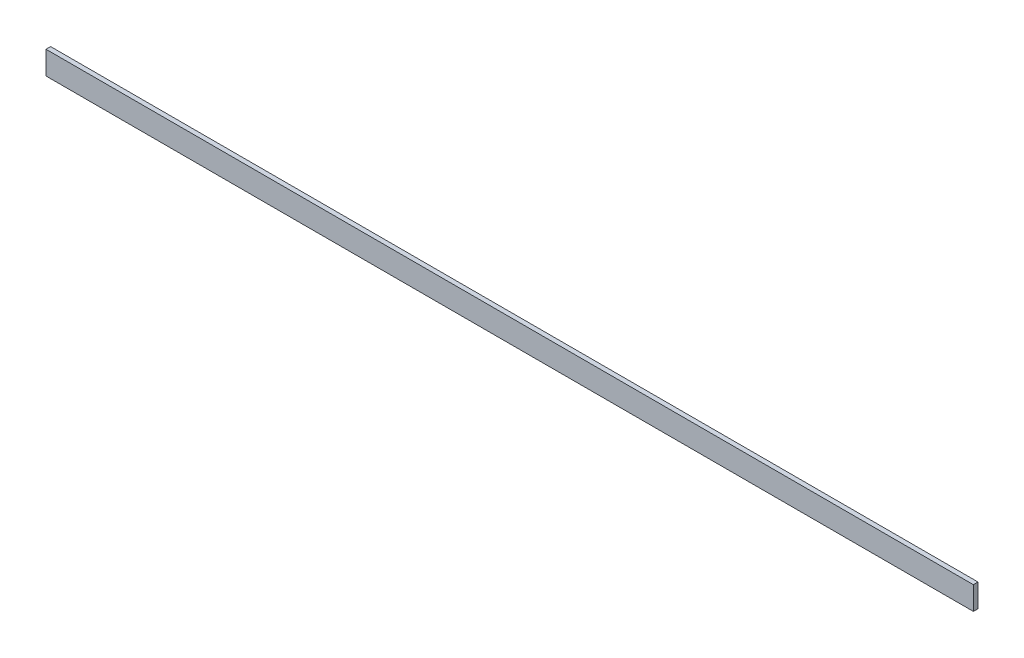
ISO-10303-21;
HEADER;
FILE_DESCRIPTION(('STEP AP214'),'2;1');
FILE_NAME('part.step','',(''),(''),'','','');
FILE_SCHEMA(('AUTOMOTIVE_DESIGN { 1 0 10303 214 1 1 1 1 }'));
ENDSEC;
DATA;
#1=APPLICATION_CONTEXT('core data for automotive mechanical design processes');
#2=APPLICATION_PROTOCOL_DEFINITION('international standard','automotive_design',2000,#1);
#3=PRODUCT_CONTEXT('',#1,'mechanical');
#4=PRODUCT('Part','Part','',(#3));
#5=PRODUCT_RELATED_PRODUCT_CATEGORY('part','',(#4));
#6=PRODUCT_DEFINITION_FORMATION('','',#4);
#7=PRODUCT_DEFINITION_CONTEXT('part definition',#1,'design');
#8=PRODUCT_DEFINITION('design','',#6,#7);
#9=PRODUCT_DEFINITION_SHAPE('','',#8);
#10=(LENGTH_UNIT() NAMED_UNIT(*) SI_UNIT(.MILLI.,.METRE.));
#11=(NAMED_UNIT(*) PLANE_ANGLE_UNIT() SI_UNIT($,.RADIAN.));
#12=(NAMED_UNIT(*) SI_UNIT($,.STERADIAN.) SOLID_ANGLE_UNIT());
#13=UNCERTAINTY_MEASURE_WITH_UNIT(LENGTH_MEASURE(1.E-05),#10,'distance_accuracy_value','');
#14=(GEOMETRIC_REPRESENTATION_CONTEXT(3) GLOBAL_UNCERTAINTY_ASSIGNED_CONTEXT((#13)) GLOBAL_UNIT_ASSIGNED_CONTEXT((#10,
#11,#12)) REPRESENTATION_CONTEXT('',''));
#15=CARTESIAN_POINT('',(0.,0.,0.));
#16=DIRECTION('',(0.,0.,1.));
#17=DIRECTION('',(1.,0.,0.));
#18=AXIS2_PLACEMENT_3D('',#15,#16,#17);
#19=CARTESIAN_POINT('',(0.,0.,3.));
#20=DIRECTION('',(1.,0.,0.));
#21=DIRECTION('',(0.,0.,-1.));
#22=AXIS2_PLACEMENT_3D('',#19,#20,#21);
#23=PLANE('',#22);
#24=DIRECTION('',(0.,-1.,0.));
#25=VECTOR('',#24,1.);
#26=CARTESIAN_POINT('',(0.,0.,0.));
#27=LINE('',#26,#25);
#28=CARTESIAN_POINT('',(0.,15.,0.));
#29=VERTEX_POINT('',#28);
#30=CARTESIAN_POINT('',(0.,0.,0.));
#31=VERTEX_POINT('',#30);
#32=EDGE_CURVE('E102',#29,#31,#27,.T.);
#33=ORIENTED_EDGE('',*,*,#32,.T.);
#34=DIRECTION('',(0.,0.,-1.));
#35=VECTOR('',#34,1.);
#36=CARTESIAN_POINT('',(0.,0.,3.));
#37=LINE('',#36,#35);
#38=CARTESIAN_POINT('',(0.,0.,3.));
#39=VERTEX_POINT('',#38);
#40=EDGE_CURVE('E11',#39,#31,#37,.T.);
#41=ORIENTED_EDGE('',*,*,#40,.F.);
#42=DIRECTION('',(0.,-1.,0.));
#43=VECTOR('',#42,1.);
#44=CARTESIAN_POINT('',(0.,0.,3.));
#45=LINE('',#44,#43);
#46=CARTESIAN_POINT('',(0.,15.,3.));
#47=VERTEX_POINT('',#46);
#48=EDGE_CURVE('E90',#47,#39,#45,.T.);
#49=ORIENTED_EDGE('',*,*,#48,.F.);
#50=DIRECTION('',(0.,0.,-1.));
#51=VECTOR('',#50,1.);
#52=CARTESIAN_POINT('',(0.,15.,3.));
#53=LINE('',#52,#51);
#54=EDGE_CURVE('E98',#47,#29,#53,.T.);
#55=ORIENTED_EDGE('',*,*,#54,.T.);
#56=EDGE_LOOP('',(#33,#41,#49,#55));
#57=FACE_BOUND('',#56,.T.);
#58=ADVANCED_FACE('F39',(#57),#23,.F.);
#59=CARTESIAN_POINT('',(0.,0.,3.));
#60=DIRECTION('',(0.,1.,0.));
#61=DIRECTION('',(0.,0.,1.));
#62=AXIS2_PLACEMENT_3D('',#59,#60,#61);
#63=PLANE('',#62);
#64=DIRECTION('',(1.,0.,0.));
#65=VECTOR('',#64,1.);
#66=CARTESIAN_POINT('',(0.,0.,0.));
#67=LINE('',#66,#65);
#68=CARTESIAN_POINT('',(600.,0.,0.));
#69=VERTEX_POINT('',#68);
#70=EDGE_CURVE('E94',#31,#69,#67,.T.);
#71=ORIENTED_EDGE('',*,*,#70,.T.);
#72=DIRECTION('',(0.,0.,-1.));
#73=VECTOR('',#72,1.);
#74=CARTESIAN_POINT('',(600.,0.,3.));
#75=LINE('',#74,#73);
#76=CARTESIAN_POINT('',(600.,0.,3.));
#77=VERTEX_POINT('',#76);
#78=EDGE_CURVE('E47',#77,#69,#75,.T.);
#79=ORIENTED_EDGE('',*,*,#78,.F.);
#80=DIRECTION('',(1.,0.,0.));
#81=VECTOR('',#80,1.);
#82=CARTESIAN_POINT('',(0.,0.,3.));
#83=LINE('',#82,#81);
#84=EDGE_CURVE('E85',#39,#77,#83,.T.);
#85=ORIENTED_EDGE('',*,*,#84,.F.);
#86=ORIENTED_EDGE('',*,*,#40,.T.);
#87=EDGE_LOOP('',(#71,#79,#85,#86));
#88=FACE_BOUND('',#87,.T.);
#89=ADVANCED_FACE('F93',(#88),#63,.F.);
#90=CARTESIAN_POINT('',(600.,0.,3.));
#91=DIRECTION('',(-1.,0.,0.));
#92=DIRECTION('',(0.,0.,1.));
#93=AXIS2_PLACEMENT_3D('',#90,#91,#92);
#94=PLANE('',#93);
#95=DIRECTION('',(0.,1.,0.));
#96=VECTOR('',#95,1.);
#97=CARTESIAN_POINT('',(600.,0.,0.));
#98=LINE('',#97,#96);
#99=CARTESIAN_POINT('',(600.,15.,0.));
#100=VERTEX_POINT('',#99);
#101=EDGE_CURVE('E72',#69,#100,#98,.T.);
#102=ORIENTED_EDGE('',*,*,#101,.T.);
#103=DIRECTION('',(0.,0.,-1.));
#104=VECTOR('',#103,1.);
#105=CARTESIAN_POINT('',(600.,15.,3.));
#106=LINE('',#105,#104);
#107=CARTESIAN_POINT('',(600.,15.,3.));
#108=VERTEX_POINT('',#107);
#109=EDGE_CURVE('E95',#108,#100,#106,.T.);
#110=ORIENTED_EDGE('',*,*,#109,.F.);
#111=DIRECTION('',(0.,1.,0.));
#112=VECTOR('',#111,1.);
#113=CARTESIAN_POINT('',(600.,0.,3.));
#114=LINE('',#113,#112);
#115=EDGE_CURVE('E88',#77,#108,#114,.T.);
#116=ORIENTED_EDGE('',*,*,#115,.F.);
#117=ORIENTED_EDGE('',*,*,#78,.T.);
#118=EDGE_LOOP('',(#102,#110,#116,#117));
#119=FACE_BOUND('',#118,.T.);
#120=ADVANCED_FACE('F96',(#119),#94,.F.);
#121=CARTESIAN_POINT('',(0.,15.,3.));
#122=DIRECTION('',(0.,-1.,0.));
#123=DIRECTION('',(0.,0.,-1.));
#124=AXIS2_PLACEMENT_3D('',#121,#122,#123);
#125=PLANE('',#124);
#126=DIRECTION('',(-1.,0.,0.));
#127=VECTOR('',#126,1.);
#128=CARTESIAN_POINT('',(0.,15.,0.));
#129=LINE('',#128,#127);
#130=EDGE_CURVE('E78',#100,#29,#129,.T.);
#131=ORIENTED_EDGE('',*,*,#130,.T.);
#132=ORIENTED_EDGE('',*,*,#54,.F.);
#133=DIRECTION('',(-1.,0.,0.));
#134=VECTOR('',#133,1.);
#135=CARTESIAN_POINT('',(0.,15.,3.));
#136=LINE('',#135,#134);
#137=EDGE_CURVE('E55',#108,#47,#136,.T.);
#138=ORIENTED_EDGE('',*,*,#137,.F.);
#139=ORIENTED_EDGE('',*,*,#109,.T.);
#140=EDGE_LOOP('',(#131,#132,#138,#139));
#141=FACE_BOUND('',#140,.T.);
#142=ADVANCED_FACE('F109',(#141),#125,.F.);
#143=CARTESIAN_POINT('',(0.,0.,3.));
#144=DIRECTION('',(0.,0.,-1.));
#145=DIRECTION('',(-1.,0.,0.));
#146=AXIS2_PLACEMENT_3D('',#143,#144,#145);
#147=PLANE('',#146);
#148=ORIENTED_EDGE('',*,*,#48,.T.);
#149=ORIENTED_EDGE('',*,*,#84,.T.);
#150=ORIENTED_EDGE('',*,*,#115,.T.);
#151=ORIENTED_EDGE('',*,*,#137,.T.);
#152=EDGE_LOOP('',(#148,#149,#150,#151));
#153=FACE_BOUND('',#152,.T.);
#154=ADVANCED_FACE('F86',(#153),#147,.F.);
#155=CARTESIAN_POINT('',(0.,0.,0.));
#156=DIRECTION('',(0.,0.,-1.));
#157=DIRECTION('',(-1.,0.,0.));
#158=AXIS2_PLACEMENT_3D('',#155,#156,#157);
#159=PLANE('',#158);
#160=ORIENTED_EDGE('',*,*,#32,.F.);
#161=ORIENTED_EDGE('',*,*,#130,.F.);
#162=ORIENTED_EDGE('',*,*,#101,.F.);
#163=ORIENTED_EDGE('',*,*,#70,.F.);
#164=EDGE_LOOP('',(#160,#161,#162,#163));
#165=FACE_BOUND('',#164,.T.);
#166=ADVANCED_FACE('F112',(#165),#159,.T.);
#167=CLOSED_SHELL('',(#58,#89,#120,#142,#154,#166));
#168=MANIFOLD_SOLID_BREP('B2',#167);
#169=ADVANCED_BREP_SHAPE_REPRESENTATION('',(#18,#168),#14);
#170=SHAPE_DEFINITION_REPRESENTATION(#9,#169);
ENDSEC;
END-ISO-10303-21;
